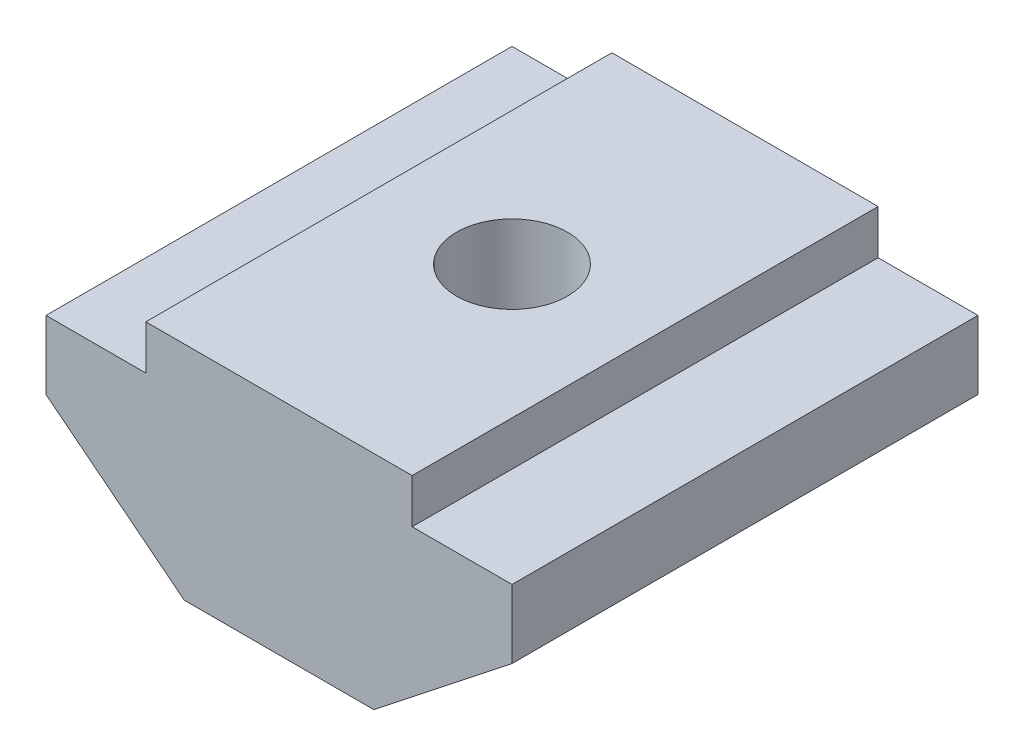
ISO-10303-21;
HEADER;
FILE_DESCRIPTION(('STEP AP214'),'2;1');
FILE_NAME('part.step','',(''),(''),'','','');
FILE_SCHEMA(('AUTOMOTIVE_DESIGN { 1 0 10303 214 1 1 1 1 }'));
ENDSEC;
DATA;
#1=APPLICATION_CONTEXT('core data for automotive mechanical design processes');
#2=APPLICATION_PROTOCOL_DEFINITION('international standard','automotive_design',2000,#1);
#3=PRODUCT_CONTEXT('',#1,'mechanical');
#4=PRODUCT('Part','Part','',(#3));
#5=PRODUCT_RELATED_PRODUCT_CATEGORY('part','',(#4));
#6=PRODUCT_DEFINITION_FORMATION('','',#4);
#7=PRODUCT_DEFINITION_CONTEXT('part definition',#1,'design');
#8=PRODUCT_DEFINITION('design','',#6,#7);
#9=PRODUCT_DEFINITION_SHAPE('','',#8);
#10=(LENGTH_UNIT() NAMED_UNIT(*) SI_UNIT(.MILLI.,.METRE.));
#11=(NAMED_UNIT(*) PLANE_ANGLE_UNIT() SI_UNIT($,.RADIAN.));
#12=(NAMED_UNIT(*) SI_UNIT($,.STERADIAN.) SOLID_ANGLE_UNIT());
#13=UNCERTAINTY_MEASURE_WITH_UNIT(LENGTH_MEASURE(1.E-05),#10,'distance_accuracy_value','');
#14=(GEOMETRIC_REPRESENTATION_CONTEXT(3) GLOBAL_UNCERTAINTY_ASSIGNED_CONTEXT((#13)) GLOBAL_UNIT_ASSIGNED_CONTEXT((#10,
#11,#12)) REPRESENTATION_CONTEXT('',''));
#15=CARTESIAN_POINT('',(0.,0.,0.));
#16=DIRECTION('',(0.,0.,1.));
#17=DIRECTION('',(1.,0.,0.));
#18=AXIS2_PLACEMENT_3D('',#15,#16,#17);
#19=CARTESIAN_POINT('',(3.,5.,10.5));
#20=DIRECTION('',(-1.,0.,0.));
#21=DIRECTION('',(0.,-1.,0.));
#22=AXIS2_PLACEMENT_3D('',#19,#20,#21);
#23=PLANE('',#22);
#24=DIRECTION('',(0.,1.,0.));
#25=VECTOR('',#24,1.);
#26=CARTESIAN_POINT('',(3.,5.,0.));
#27=LINE('',#26,#25);
#28=CARTESIAN_POINT('',(3.,4.,0.));
#29=VERTEX_POINT('',#28);
#30=CARTESIAN_POINT('',(3.,5.,0.));
#31=VERTEX_POINT('',#30);
#32=EDGE_CURVE('E146',#29,#31,#27,.T.);
#33=ORIENTED_EDGE('',*,*,#32,.T.);
#34=DIRECTION('',(0.,0.,-1.));
#35=VECTOR('',#34,1.);
#36=CARTESIAN_POINT('',(3.,5.,10.5));
#37=LINE('',#36,#35);
#38=CARTESIAN_POINT('',(3.,5.,10.5));
#39=VERTEX_POINT('',#38);
#40=EDGE_CURVE('E11',#39,#31,#37,.T.);
#41=ORIENTED_EDGE('',*,*,#40,.F.);
#42=DIRECTION('',(0.,1.,0.));
#43=VECTOR('',#42,1.);
#44=CARTESIAN_POINT('',(3.,5.,10.5));
#45=LINE('',#44,#43);
#46=CARTESIAN_POINT('',(3.,4.,10.5));
#47=VERTEX_POINT('',#46);
#48=EDGE_CURVE('E165',#47,#39,#45,.T.);
#49=ORIENTED_EDGE('',*,*,#48,.F.);
#50=DIRECTION('',(0.,0.,-1.));
#51=VECTOR('',#50,1.);
#52=CARTESIAN_POINT('',(3.,4.,10.5));
#53=LINE('',#52,#51);
#54=EDGE_CURVE('E142',#47,#29,#53,.T.);
#55=ORIENTED_EDGE('',*,*,#54,.T.);
#56=EDGE_LOOP('',(#33,#41,#49,#55));
#57=FACE_BOUND('',#56,.T.);
#58=ADVANCED_FACE('F38',(#57),#23,.F.);
#59=CARTESIAN_POINT('',(-3.,5.,10.5));
#60=DIRECTION('',(0.,-1.,0.));
#61=DIRECTION('',(0.,0.,-1.));
#62=AXIS2_PLACEMENT_3D('',#59,#60,#61);
#63=PLANE('',#62);
#64=CARTESIAN_POINT('',(0.,5.,5.24999999999998));
#65=DIRECTION('',(0.,1.,0.));
#66=DIRECTION('',(0.,0.,1.));
#67=AXIS2_PLACEMENT_3D('',#64,#65,#66);
#68=CIRCLE('',#67,1.25);
#69=CARTESIAN_POINT('',(0.,5.,6.49999999999998));
#70=VERTEX_POINT('',#69);
#71=EDGE_CURVE('E214',#70,#70,#68,.T.);
#72=ORIENTED_EDGE('',*,*,#71,.F.);
#73=EDGE_LOOP('',(#72));
#74=FACE_BOUND('',#73,.T.);
#75=DIRECTION('',(-1.,0.,0.));
#76=VECTOR('',#75,1.);
#77=CARTESIAN_POINT('',(-3.,5.,0.));
#78=LINE('',#77,#76);
#79=CARTESIAN_POINT('',(-3.,5.,0.));
#80=VERTEX_POINT('',#79);
#81=EDGE_CURVE('E149',#31,#80,#78,.T.);
#82=ORIENTED_EDGE('',*,*,#81,.T.);
#83=DIRECTION('',(0.,0.,-1.));
#84=VECTOR('',#83,1.);
#85=CARTESIAN_POINT('',(-3.,5.,10.5));
#86=LINE('',#85,#84);
#87=CARTESIAN_POINT('',(-3.,5.,10.5));
#88=VERTEX_POINT('',#87);
#89=EDGE_CURVE('E46',#88,#80,#86,.T.);
#90=ORIENTED_EDGE('',*,*,#89,.F.);
#91=DIRECTION('',(-1.,0.,0.));
#92=VECTOR('',#91,1.);
#93=CARTESIAN_POINT('',(-3.,5.,10.5));
#94=LINE('',#93,#92);
#95=EDGE_CURVE('E103',#39,#88,#94,.T.);
#96=ORIENTED_EDGE('',*,*,#95,.F.);
#97=ORIENTED_EDGE('',*,*,#40,.T.);
#98=EDGE_LOOP('',(#82,#90,#96,#97));
#99=FACE_BOUND('',#98,.T.);
#100=ADVANCED_FACE('F220',(#74,#99),#63,.F.);
#101=CARTESIAN_POINT('',(-3.,5.,10.5));
#102=DIRECTION('',(1.,0.,0.));
#103=DIRECTION('',(0.,1.,0.));
#104=AXIS2_PLACEMENT_3D('',#101,#102,#103);
#105=PLANE('',#104);
#106=DIRECTION('',(0.,-1.,0.));
#107=VECTOR('',#106,1.);
#108=CARTESIAN_POINT('',(-3.,5.,0.));
#109=LINE('',#108,#107);
#110=CARTESIAN_POINT('',(-3.,4.,0.));
#111=VERTEX_POINT('',#110);
#112=EDGE_CURVE('E152',#80,#111,#109,.T.);
#113=ORIENTED_EDGE('',*,*,#112,.T.);
#114=DIRECTION('',(0.,0.,-1.));
#115=VECTOR('',#114,1.);
#116=CARTESIAN_POINT('',(-3.,4.,10.5));
#117=LINE('',#116,#115);
#118=CARTESIAN_POINT('',(-3.,4.,10.5));
#119=VERTEX_POINT('',#118);
#120=EDGE_CURVE('E178',#119,#111,#117,.T.);
#121=ORIENTED_EDGE('',*,*,#120,.F.);
#122=DIRECTION('',(0.,-1.,0.));
#123=VECTOR('',#122,1.);
#124=CARTESIAN_POINT('',(-3.,5.,10.5));
#125=LINE('',#124,#123);
#126=EDGE_CURVE('E186',#88,#119,#125,.T.);
#127=ORIENTED_EDGE('',*,*,#126,.F.);
#128=ORIENTED_EDGE('',*,*,#89,.T.);
#129=EDGE_LOOP('',(#113,#121,#127,#128));
#130=FACE_BOUND('',#129,.T.);
#131=ADVANCED_FACE('F184',(#130),#105,.F.);
#132=CARTESIAN_POINT('',(-3.,4.,10.5));
#133=DIRECTION('',(0.,-1.,0.));
#134=DIRECTION('',(0.,0.,-1.));
#135=AXIS2_PLACEMENT_3D('',#132,#133,#134);
#136=PLANE('',#135);
#137=DIRECTION('',(-1.,0.,0.));
#138=VECTOR('',#137,1.);
#139=CARTESIAN_POINT('',(-3.,4.,0.));
#140=LINE('',#139,#138);
#141=CARTESIAN_POINT('',(-5.24999999999998,4.,0.));
#142=VERTEX_POINT('',#141);
#143=EDGE_CURVE('E154',#111,#142,#140,.T.);
#144=ORIENTED_EDGE('',*,*,#143,.T.);
#145=DIRECTION('',(0.,0.,-1.));
#146=VECTOR('',#145,1.);
#147=CARTESIAN_POINT('',(-5.24999999999998,4.,10.5));
#148=LINE('',#147,#146);
#149=CARTESIAN_POINT('',(-5.24999999999998,4.,10.5));
#150=VERTEX_POINT('',#149);
#151=EDGE_CURVE('E175',#150,#142,#148,.T.);
#152=ORIENTED_EDGE('',*,*,#151,.F.);
#153=DIRECTION('',(-1.,0.,0.));
#154=VECTOR('',#153,1.);
#155=CARTESIAN_POINT('',(-3.,4.,10.5));
#156=LINE('',#155,#154);
#157=EDGE_CURVE('E204',#119,#150,#156,.T.);
#158=ORIENTED_EDGE('',*,*,#157,.F.);
#159=ORIENTED_EDGE('',*,*,#120,.T.);
#160=EDGE_LOOP('',(#144,#152,#158,#159));
#161=FACE_BOUND('',#160,.T.);
#162=ADVANCED_FACE('F195',(#161),#136,.F.);
#163=CARTESIAN_POINT('',(-5.24999999999998,4.,10.5));
#164=DIRECTION('',(1.,0.,0.));
#165=DIRECTION('',(0.,0.,-1.));
#166=AXIS2_PLACEMENT_3D('',#163,#164,#165);
#167=PLANE('',#166);
#168=DIRECTION('',(0.,-1.,0.));
#169=VECTOR('',#168,1.);
#170=CARTESIAN_POINT('',(-5.24999999999998,4.,0.));
#171=LINE('',#170,#169);
#172=CARTESIAN_POINT('',(-5.24999999999998,2.45593869111821,0.));
#173=VERTEX_POINT('',#172);
#174=EDGE_CURVE('E156',#142,#173,#171,.T.);
#175=ORIENTED_EDGE('',*,*,#174,.T.);
#176=DIRECTION('',(0.,0.,-1.));
#177=VECTOR('',#176,1.);
#178=CARTESIAN_POINT('',(-5.24999999999998,2.45593869111821,10.5));
#179=LINE('',#178,#177);
#180=CARTESIAN_POINT('',(-5.24999999999998,2.45593869111821,10.5));
#181=VERTEX_POINT('',#180);
#182=EDGE_CURVE('E172',#181,#173,#179,.T.);
#183=ORIENTED_EDGE('',*,*,#182,.F.);
#184=DIRECTION('',(0.,-1.,0.));
#185=VECTOR('',#184,1.);
#186=CARTESIAN_POINT('',(-5.24999999999998,4.,10.5));
#187=LINE('',#186,#185);
#188=EDGE_CURVE('E201',#150,#181,#187,.T.);
#189=ORIENTED_EDGE('',*,*,#188,.F.);
#190=ORIENTED_EDGE('',*,*,#151,.T.);
#191=EDGE_LOOP('',(#175,#183,#189,#190));
#192=FACE_BOUND('',#191,.T.);
#193=ADVANCED_FACE('F199',(#192),#167,.F.);
#194=CARTESIAN_POINT('',(-5.24999999999998,2.45593869111821,10.5));
#195=DIRECTION('',(0.619208751305956,0.78522641467676,0.));
#196=DIRECTION('',(-0.78522641467676,0.619208751305956,0.));
#197=AXIS2_PLACEMENT_3D('',#194,#195,#196);
#198=PLANE('',#197);
#199=DIRECTION('',(0.78522641467676,-0.619208751305956,0.));
#200=VECTOR('',#199,1.);
#201=CARTESIAN_POINT('',(-5.24999999999998,2.45593869111821,0.));
#202=LINE('',#201,#200);
#203=CARTESIAN_POINT('',(-2.13559322033896,0.,0.));
#204=VERTEX_POINT('',#203);
#205=EDGE_CURVE('E158',#173,#204,#202,.T.);
#206=ORIENTED_EDGE('',*,*,#205,.T.);
#207=DIRECTION('',(0.,0.,-1.));
#208=VECTOR('',#207,1.);
#209=CARTESIAN_POINT('',(-2.13559322033896,0.,10.5));
#210=LINE('',#209,#208);
#211=CARTESIAN_POINT('',(-2.13559322033896,0.,10.5));
#212=VERTEX_POINT('',#211);
#213=EDGE_CURVE('E169',#212,#204,#210,.T.);
#214=ORIENTED_EDGE('',*,*,#213,.F.);
#215=DIRECTION('',(0.78522641467676,-0.619208751305956,0.));
#216=VECTOR('',#215,1.);
#217=CARTESIAN_POINT('',(-5.24999999999998,2.45593869111821,10.5));
#218=LINE('',#217,#216);
#219=EDGE_CURVE('E203',#181,#212,#218,.T.);
#220=ORIENTED_EDGE('',*,*,#219,.F.);
#221=ORIENTED_EDGE('',*,*,#182,.T.);
#222=EDGE_LOOP('',(#206,#214,#220,#221));
#223=FACE_BOUND('',#222,.T.);
#224=ADVANCED_FACE('F230',(#223),#198,.F.);
#225=CARTESIAN_POINT('',(2.13559322033896,0.,10.5));
#226=DIRECTION('',(0.,1.,0.));
#227=DIRECTION('',(0.,0.,1.));
#228=AXIS2_PLACEMENT_3D('',#225,#226,#227);
#229=PLANE('',#228);
#230=CARTESIAN_POINT('',(0.,0.,5.24999999999998));
#231=DIRECTION('',(0.,1.,0.));
#232=DIRECTION('',(0.,0.,1.));
#233=AXIS2_PLACEMENT_3D('',#230,#231,#232);
#234=CIRCLE('',#233,1.25);
#235=CARTESIAN_POINT('',(0.,0.,6.49999999999997));
#236=VERTEX_POINT('',#235);
#237=EDGE_CURVE('E150',#236,#236,#234,.T.);
#238=ORIENTED_EDGE('',*,*,#237,.T.);
#239=EDGE_LOOP('',(#238));
#240=FACE_BOUND('',#239,.T.);
#241=DIRECTION('',(1.,0.,0.));
#242=VECTOR('',#241,1.);
#243=CARTESIAN_POINT('',(2.13559322033896,0.,0.));
#244=LINE('',#243,#242);
#245=CARTESIAN_POINT('',(2.13559322033896,0.,0.));
#246=VERTEX_POINT('',#245);
#247=EDGE_CURVE('E160',#204,#246,#244,.T.);
#248=ORIENTED_EDGE('',*,*,#247,.T.);
#249=DIRECTION('',(0.,0.,-1.));
#250=VECTOR('',#249,1.);
#251=CARTESIAN_POINT('',(2.13559322033896,0.,10.5));
#252=LINE('',#251,#250);
#253=CARTESIAN_POINT('',(2.13559322033896,0.,10.5));
#254=VERTEX_POINT('',#253);
#255=EDGE_CURVE('E137',#254,#246,#252,.T.);
#256=ORIENTED_EDGE('',*,*,#255,.F.);
#257=DIRECTION('',(1.,0.,0.));
#258=VECTOR('',#257,1.);
#259=CARTESIAN_POINT('',(2.13559322033896,0.,10.5));
#260=LINE('',#259,#258);
#261=EDGE_CURVE('E128',#212,#254,#260,.T.);
#262=ORIENTED_EDGE('',*,*,#261,.F.);
#263=ORIENTED_EDGE('',*,*,#213,.T.);
#264=EDGE_LOOP('',(#248,#256,#262,#263));
#265=FACE_BOUND('',#264,.T.);
#266=ADVANCED_FACE('F227',(#240,#265),#229,.F.);
#267=CARTESIAN_POINT('',(5.24999999999998,2.45593869111821,10.5));
#268=DIRECTION('',(-0.619208751305956,0.78522641467676,0.));
#269=DIRECTION('',(-0.78522641467676,-0.619208751305956,0.));
#270=AXIS2_PLACEMENT_3D('',#267,#268,#269);
#271=PLANE('',#270);
#272=DIRECTION('',(0.78522641467676,0.619208751305956,0.));
#273=VECTOR('',#272,1.);
#274=CARTESIAN_POINT('',(5.24999999999998,2.45593869111821,0.));
#275=LINE('',#274,#273);
#276=CARTESIAN_POINT('',(5.24999999999998,2.45593869111821,0.));
#277=VERTEX_POINT('',#276);
#278=EDGE_CURVE('E136',#246,#277,#275,.T.);
#279=ORIENTED_EDGE('',*,*,#278,.T.);
#280=DIRECTION('',(0.,0.,-1.));
#281=VECTOR('',#280,1.);
#282=CARTESIAN_POINT('',(5.24999999999998,2.45593869111821,10.5));
#283=LINE('',#282,#281);
#284=CARTESIAN_POINT('',(5.24999999999998,2.45593869111821,10.5));
#285=VERTEX_POINT('',#284);
#286=EDGE_CURVE('E133',#285,#277,#283,.T.);
#287=ORIENTED_EDGE('',*,*,#286,.F.);
#288=DIRECTION('',(0.78522641467676,0.619208751305956,0.));
#289=VECTOR('',#288,1.);
#290=CARTESIAN_POINT('',(5.24999999999998,2.45593869111821,10.5));
#291=LINE('',#290,#289);
#292=EDGE_CURVE('E122',#254,#285,#291,.T.);
#293=ORIENTED_EDGE('',*,*,#292,.F.);
#294=ORIENTED_EDGE('',*,*,#255,.T.);
#295=EDGE_LOOP('',(#279,#287,#293,#294));
#296=FACE_BOUND('',#295,.T.);
#297=ADVANCED_FACE('F134',(#296),#271,.F.);
#298=CARTESIAN_POINT('',(5.24999999999998,4.,10.5));
#299=DIRECTION('',(-1.,0.,0.));
#300=DIRECTION('',(0.,0.,1.));
#301=AXIS2_PLACEMENT_3D('',#298,#299,#300);
#302=PLANE('',#301);
#303=DIRECTION('',(0.,1.,0.));
#304=VECTOR('',#303,1.);
#305=CARTESIAN_POINT('',(5.24999999999998,4.,0.));
#306=LINE('',#305,#304);
#307=CARTESIAN_POINT('',(5.24999999999998,4.,0.));
#308=VERTEX_POINT('',#307);
#309=EDGE_CURVE('E89',#277,#308,#306,.T.);
#310=ORIENTED_EDGE('',*,*,#309,.T.);
#311=DIRECTION('',(0.,0.,-1.));
#312=VECTOR('',#311,1.);
#313=CARTESIAN_POINT('',(5.24999999999998,4.,10.5));
#314=LINE('',#313,#312);
#315=CARTESIAN_POINT('',(5.24999999999998,4.,10.5));
#316=VERTEX_POINT('',#315);
#317=EDGE_CURVE('E138',#316,#308,#314,.T.);
#318=ORIENTED_EDGE('',*,*,#317,.F.);
#319=DIRECTION('',(0.,1.,0.));
#320=VECTOR('',#319,1.);
#321=CARTESIAN_POINT('',(5.24999999999998,4.,10.5));
#322=LINE('',#321,#320);
#323=EDGE_CURVE('E126',#285,#316,#322,.T.);
#324=ORIENTED_EDGE('',*,*,#323,.F.);
#325=ORIENTED_EDGE('',*,*,#286,.T.);
#326=EDGE_LOOP('',(#310,#318,#324,#325));
#327=FACE_BOUND('',#326,.T.);
#328=ADVANCED_FACE('F140',(#327),#302,.F.);
#329=CARTESIAN_POINT('',(3.,4.,10.5));
#330=DIRECTION('',(0.,-1.,0.));
#331=DIRECTION('',(0.,0.,-1.));
#332=AXIS2_PLACEMENT_3D('',#329,#330,#331);
#333=PLANE('',#332);
#334=DIRECTION('',(-1.,0.,0.));
#335=VECTOR('',#334,1.);
#336=CARTESIAN_POINT('',(3.,4.,0.));
#337=LINE('',#336,#335);
#338=EDGE_CURVE('E95',#308,#29,#337,.T.);
#339=ORIENTED_EDGE('',*,*,#338,.T.);
#340=ORIENTED_EDGE('',*,*,#54,.F.);
#341=DIRECTION('',(-1.,0.,0.));
#342=VECTOR('',#341,1.);
#343=CARTESIAN_POINT('',(3.,4.,10.5));
#344=LINE('',#343,#342);
#345=EDGE_CURVE('E54',#316,#47,#344,.T.);
#346=ORIENTED_EDGE('',*,*,#345,.F.);
#347=ORIENTED_EDGE('',*,*,#317,.T.);
#348=EDGE_LOOP('',(#339,#340,#346,#347));
#349=FACE_BOUND('',#348,.T.);
#350=ADVANCED_FACE('F290',(#349),#333,.F.);
#351=CARTESIAN_POINT('',(0.,0.,10.5));
#352=DIRECTION('',(0.,0.,1.));
#353=DIRECTION('',(1.,0.,0.));
#354=AXIS2_PLACEMENT_3D('',#351,#352,#353);
#355=PLANE('',#354);
#356=ORIENTED_EDGE('',*,*,#48,.T.);
#357=ORIENTED_EDGE('',*,*,#95,.T.);
#358=ORIENTED_EDGE('',*,*,#126,.T.);
#359=ORIENTED_EDGE('',*,*,#157,.T.);
#360=ORIENTED_EDGE('',*,*,#188,.T.);
#361=ORIENTED_EDGE('',*,*,#219,.T.);
#362=ORIENTED_EDGE('',*,*,#261,.T.);
#363=ORIENTED_EDGE('',*,*,#292,.T.);
#364=ORIENTED_EDGE('',*,*,#323,.T.);
#365=ORIENTED_EDGE('',*,*,#345,.T.);
#366=EDGE_LOOP('',(#356,#357,#358,#359,#360,#361,#362,#363,#364,#365));
#367=FACE_BOUND('',#366,.T.);
#368=ADVANCED_FACE('F124',(#367),#355,.T.);
#369=CARTESIAN_POINT('',(0.,0.,0.));
#370=DIRECTION('',(0.,0.,1.));
#371=DIRECTION('',(1.,0.,0.));
#372=AXIS2_PLACEMENT_3D('',#369,#370,#371);
#373=PLANE('',#372);
#374=ORIENTED_EDGE('',*,*,#32,.F.);
#375=ORIENTED_EDGE('',*,*,#338,.F.);
#376=ORIENTED_EDGE('',*,*,#309,.F.);
#377=ORIENTED_EDGE('',*,*,#278,.F.);
#378=ORIENTED_EDGE('',*,*,#247,.F.);
#379=ORIENTED_EDGE('',*,*,#205,.F.);
#380=ORIENTED_EDGE('',*,*,#174,.F.);
#381=ORIENTED_EDGE('',*,*,#143,.F.);
#382=ORIENTED_EDGE('',*,*,#112,.F.);
#383=ORIENTED_EDGE('',*,*,#81,.F.);
#384=EDGE_LOOP('',(#374,#375,#376,#377,#378,#379,#380,#381,#382,#383));
#385=FACE_BOUND('',#384,.T.);
#386=ADVANCED_FACE('F190',(#385),#373,.F.);
#387=CARTESIAN_POINT('',(0.,5.,5.24999999999998));
#388=DIRECTION('',(0.,1.,0.));
#389=DIRECTION('',(0.,0.,1.));
#390=AXIS2_PLACEMENT_3D('',#387,#388,#389);
#391=CYLINDRICAL_SURFACE('',#390,1.25);
#392=ORIENTED_EDGE('',*,*,#237,.F.);
#393=EDGE_LOOP('',(#392));
#394=FACE_BOUND('',#393,.T.);
#395=ORIENTED_EDGE('',*,*,#71,.T.);
#396=EDGE_LOOP('',(#395));
#397=FACE_BOUND('',#396,.T.);
#398=ADVANCED_FACE('F218',(#394,#397),#391,.F.);
#399=CLOSED_SHELL('',(#58,#100,#131,#162,#193,#224,#266,#297,#328,#350,#368,#386,#398));
#400=MANIFOLD_SOLID_BREP('B2',#399);
#401=ADVANCED_BREP_SHAPE_REPRESENTATION('',(#18,#400),#14);
#402=SHAPE_DEFINITION_REPRESENTATION(#9,#401);
ENDSEC;
END-ISO-10303-21;
